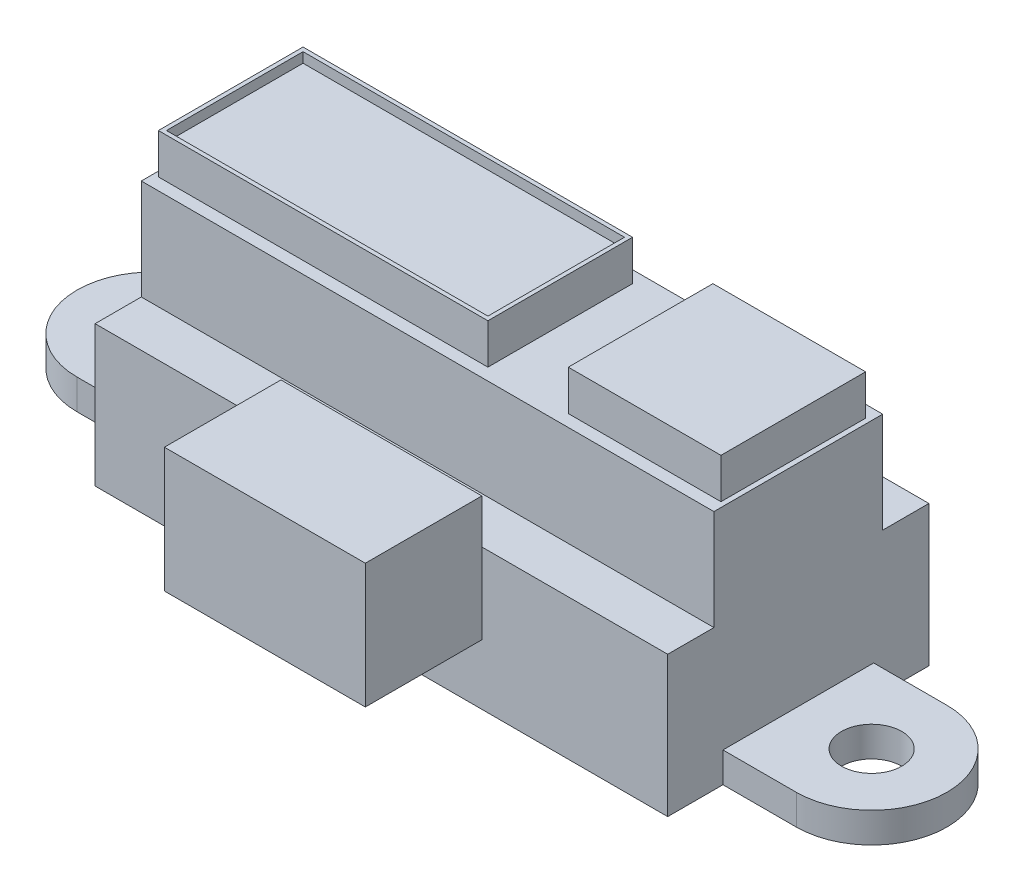
ISO-10303-21;
HEADER;
FILE_DESCRIPTION(('STEP AP214'),'2;1');
FILE_NAME('part.step','',(''),(''),'','','');
FILE_SCHEMA(('AUTOMOTIVE_DESIGN { 1 0 10303 214 1 1 1 1 }'));
ENDSEC;
DATA;
#1=APPLICATION_CONTEXT('core data for automotive mechanical design processes');
#2=APPLICATION_PROTOCOL_DEFINITION('international standard','automotive_design',2000,#1);
#3=PRODUCT_CONTEXT('',#1,'mechanical');
#4=PRODUCT('Part','Part','',(#3));
#5=PRODUCT_RELATED_PRODUCT_CATEGORY('part','',(#4));
#6=PRODUCT_DEFINITION_FORMATION('','',#4);
#7=PRODUCT_DEFINITION_CONTEXT('part definition',#1,'design');
#8=PRODUCT_DEFINITION('design','',#6,#7);
#9=PRODUCT_DEFINITION_SHAPE('','',#8);
#10=(LENGTH_UNIT() NAMED_UNIT(*) SI_UNIT(.MILLI.,.METRE.));
#11=(NAMED_UNIT(*) PLANE_ANGLE_UNIT() SI_UNIT($,.RADIAN.));
#12=(NAMED_UNIT(*) SI_UNIT($,.STERADIAN.) SOLID_ANGLE_UNIT());
#13=UNCERTAINTY_MEASURE_WITH_UNIT(LENGTH_MEASURE(1.E-05),#10,'distance_accuracy_value','');
#14=(GEOMETRIC_REPRESENTATION_CONTEXT(3) GLOBAL_UNCERTAINTY_ASSIGNED_CONTEXT((#13)) GLOBAL_UNIT_ASSIGNED_CONTEXT((#10,
#11,#12)) REPRESENTATION_CONTEXT('',''));
#15=CARTESIAN_POINT('',(0.,0.,0.));
#16=DIRECTION('',(0.,0.,1.));
#17=DIRECTION('',(1.,0.,0.));
#18=AXIS2_PLACEMENT_3D('',#15,#16,#17);
#19=CARTESIAN_POINT('',(-14.25,7.,6.5));
#20=DIRECTION('',(0.,0.,-1.));
#21=DIRECTION('',(-1.,0.,0.));
#22=AXIS2_PLACEMENT_3D('',#19,#20,#21);
#23=PLANE('',#22);
#24=DIRECTION('',(0.,-1.,0.));
#25=VECTOR('',#24,1.);
#26=CARTESIAN_POINT('',(-5.,9.2,6.5));
#27=LINE('',#26,#25);
#28=CARTESIAN_POINT('',(-5.,7.,6.5));
#29=VERTEX_POINT('',#28);
#30=CARTESIAN_POINT('',(-5.,3.,6.5));
#31=VERTEX_POINT('',#30);
#32=EDGE_CURVE('E11',#29,#31,#27,.T.);
#33=ORIENTED_EDGE('',*,*,#32,.F.);
#34=DIRECTION('',(1.,0.,0.));
#35=VECTOR('',#34,1.);
#36=CARTESIAN_POINT('',(-14.25,7.,6.5));
#37=LINE('',#36,#35);
#38=CARTESIAN_POINT('',(-14.25,7.,6.5));
#39=VERTEX_POINT('',#38);
#40=EDGE_CURVE('E481',#39,#29,#37,.T.);
#41=ORIENTED_EDGE('',*,*,#40,.F.);
#42=DIRECTION('',(0.,-1.,0.));
#43=VECTOR('',#42,1.);
#44=CARTESIAN_POINT('',(-14.25,7.,6.5));
#45=LINE('',#44,#43);
#46=CARTESIAN_POINT('',(-14.25,0.,6.5));
#47=VERTEX_POINT('',#46);
#48=EDGE_CURVE('E499',#39,#47,#45,.T.);
#49=ORIENTED_EDGE('',*,*,#48,.T.);
#50=DIRECTION('',(1.,0.,0.));
#51=VECTOR('',#50,1.);
#52=CARTESIAN_POINT('',(-14.25,0.,6.5));
#53=LINE('',#52,#51);
#54=CARTESIAN_POINT('',(14.25,0.,6.5));
#55=VERTEX_POINT('',#54);
#56=EDGE_CURVE('E495',#47,#55,#53,.T.);
#57=ORIENTED_EDGE('',*,*,#56,.T.);
#58=DIRECTION('',(0.,-1.,0.));
#59=VECTOR('',#58,1.);
#60=CARTESIAN_POINT('',(14.25,7.,6.5));
#61=LINE('',#60,#59);
#62=CARTESIAN_POINT('',(14.25,7.,6.5));
#63=VERTEX_POINT('',#62);
#64=EDGE_CURVE('E484',#63,#55,#61,.T.);
#65=ORIENTED_EDGE('',*,*,#64,.F.);
#66=CARTESIAN_POINT('',(5.,7.,6.5));
#67=VERTEX_POINT('',#66);
#68=EDGE_CURVE('E480',#67,#63,#37,.T.);
#69=ORIENTED_EDGE('',*,*,#68,.F.);
#70=DIRECTION('',(0.,-1.,0.));
#71=VECTOR('',#70,1.);
#72=CARTESIAN_POINT('',(5.,9.2,6.5));
#73=LINE('',#72,#71);
#74=CARTESIAN_POINT('',(5.,3.,6.5));
#75=VERTEX_POINT('',#74);
#76=EDGE_CURVE('E42',#67,#75,#73,.T.);
#77=ORIENTED_EDGE('',*,*,#76,.T.);
#78=DIRECTION('',(-1.,0.,0.));
#79=VECTOR('',#78,1.);
#80=CARTESIAN_POINT('',(-5.,3.,6.5));
#81=LINE('',#80,#79);
#82=EDGE_CURVE('E51',#75,#31,#81,.T.);
#83=ORIENTED_EDGE('',*,*,#82,.T.);
#84=EDGE_LOOP('',(#33,#41,#49,#57,#65,#69,#77,#83));
#85=FACE_BOUND('',#84,.T.);
#86=ADVANCED_FACE('F33',(#85),#23,.F.);
#87=CARTESIAN_POINT('',(14.25,7.,6.5));
#88=DIRECTION('',(-1.,0.,0.));
#89=DIRECTION('',(0.,0.,1.));
#90=AXIS2_PLACEMENT_3D('',#87,#88,#89);
#91=PLANE('',#90);
#92=DIRECTION('',(0.,-1.,0.));
#93=VECTOR('',#92,1.);
#94=CARTESIAN_POINT('',(14.25,1.5,3.75));
#95=LINE('',#94,#93);
#96=CARTESIAN_POINT('',(14.25,1.5,3.75));
#97=VERTEX_POINT('',#96);
#98=CARTESIAN_POINT('',(14.25,0.,3.75));
#99=VERTEX_POINT('',#98);
#100=EDGE_CURVE('E309',#97,#99,#95,.T.);
#101=ORIENTED_EDGE('',*,*,#100,.F.);
#102=DIRECTION('',(0.,0.,-1.));
#103=VECTOR('',#102,1.);
#104=CARTESIAN_POINT('',(14.25,1.5,-3.75));
#105=LINE('',#104,#103);
#106=CARTESIAN_POINT('',(14.25,1.5,-3.75));
#107=VERTEX_POINT('',#106);
#108=EDGE_CURVE('E289',#97,#107,#105,.T.);
#109=ORIENTED_EDGE('',*,*,#108,.T.);
#110=DIRECTION('',(0.,-1.,0.));
#111=VECTOR('',#110,1.);
#112=CARTESIAN_POINT('',(14.25,1.5,-3.75));
#113=LINE('',#112,#111);
#114=CARTESIAN_POINT('',(14.25,0.,-3.75));
#115=VERTEX_POINT('',#114);
#116=EDGE_CURVE('E311',#107,#115,#113,.T.);
#117=ORIENTED_EDGE('',*,*,#116,.T.);
#118=DIRECTION('',(0.,0.,-1.));
#119=VECTOR('',#118,1.);
#120=CARTESIAN_POINT('',(14.25,0.,6.5));
#121=LINE('',#120,#119);
#122=CARTESIAN_POINT('',(14.25,0.,-6.5));
#123=VERTEX_POINT('',#122);
#124=EDGE_CURVE('E471',#115,#123,#121,.T.);
#125=ORIENTED_EDGE('',*,*,#124,.T.);
#126=DIRECTION('',(0.,-1.,0.));
#127=VECTOR('',#126,1.);
#128=CARTESIAN_POINT('',(14.25,7.,-6.5));
#129=LINE('',#128,#127);
#130=CARTESIAN_POINT('',(14.25,7.,-6.5));
#131=VERTEX_POINT('',#130);
#132=EDGE_CURVE('E37',#131,#123,#129,.T.);
#133=ORIENTED_EDGE('',*,*,#132,.F.);
#134=DIRECTION('',(0.,0.,-1.));
#135=VECTOR('',#134,1.);
#136=CARTESIAN_POINT('',(14.25,7.,6.5));
#137=LINE('',#136,#135);
#138=CARTESIAN_POINT('',(14.25,7.,-4.2));
#139=VERTEX_POINT('',#138);
#140=EDGE_CURVE('E475',#139,#131,#137,.T.);
#141=ORIENTED_EDGE('',*,*,#140,.F.);
#142=DIRECTION('',(0.,-1.,0.));
#143=VECTOR('',#142,1.);
#144=CARTESIAN_POINT('',(14.25,12.,-4.2));
#145=LINE('',#144,#143);
#146=CARTESIAN_POINT('',(14.25,12.,-4.2));
#147=VERTEX_POINT('',#146);
#148=EDGE_CURVE('E468',#147,#139,#145,.T.);
#149=ORIENTED_EDGE('',*,*,#148,.F.);
#150=DIRECTION('',(0.,0.,-1.));
#151=VECTOR('',#150,1.);
#152=CARTESIAN_POINT('',(14.25,12.,4.2));
#153=LINE('',#152,#151);
#154=CARTESIAN_POINT('',(14.25,12.,4.2));
#155=VERTEX_POINT('',#154);
#156=EDGE_CURVE('E445',#155,#147,#153,.T.);
#157=ORIENTED_EDGE('',*,*,#156,.F.);
#158=DIRECTION('',(0.,-1.,0.));
#159=VECTOR('',#158,1.);
#160=CARTESIAN_POINT('',(14.25,12.,4.2));
#161=LINE('',#160,#159);
#162=CARTESIAN_POINT('',(14.25,7.,4.2));
#163=VERTEX_POINT('',#162);
#164=EDGE_CURVE('E455',#155,#163,#161,.T.);
#165=ORIENTED_EDGE('',*,*,#164,.T.);
#166=EDGE_CURVE('E472',#63,#163,#137,.T.);
#167=ORIENTED_EDGE('',*,*,#166,.F.);
#168=ORIENTED_EDGE('',*,*,#64,.T.);
#169=EDGE_CURVE('E486',#55,#99,#121,.T.);
#170=ORIENTED_EDGE('',*,*,#169,.T.);
#171=EDGE_LOOP('',(#101,#109,#117,#125,#133,#141,#149,#157,#165,#167,#168,#170));
#172=FACE_BOUND('',#171,.T.);
#173=ADVANCED_FACE('F35',(#172),#91,.F.);
#174=CARTESIAN_POINT('',(-14.25,7.,6.5));
#175=DIRECTION('',(1.,0.,0.));
#176=DIRECTION('',(0.,0.,-1.));
#177=AXIS2_PLACEMENT_3D('',#174,#175,#176);
#178=PLANE('',#177);
#179=DIRECTION('',(0.,-1.,0.));
#180=VECTOR('',#179,1.);
#181=CARTESIAN_POINT('',(-14.25,1.5,-3.75));
#182=LINE('',#181,#180);
#183=CARTESIAN_POINT('',(-14.25,1.5,-3.75));
#184=VERTEX_POINT('',#183);
#185=CARTESIAN_POINT('',(-14.25,0.,-3.75));
#186=VERTEX_POINT('',#185);
#187=EDGE_CURVE('E330',#184,#186,#182,.T.);
#188=ORIENTED_EDGE('',*,*,#187,.F.);
#189=DIRECTION('',(0.,0.,-1.));
#190=VECTOR('',#189,1.);
#191=CARTESIAN_POINT('',(-14.25,1.5,-3.75));
#192=LINE('',#191,#190);
#193=CARTESIAN_POINT('',(-14.25,1.5,3.75));
#194=VERTEX_POINT('',#193);
#195=EDGE_CURVE('E328',#194,#184,#192,.T.);
#196=ORIENTED_EDGE('',*,*,#195,.F.);
#197=DIRECTION('',(0.,-1.,0.));
#198=VECTOR('',#197,1.);
#199=CARTESIAN_POINT('',(-14.25,1.5,3.75));
#200=LINE('',#199,#198);
#201=CARTESIAN_POINT('',(-14.25,0.,3.75000000000001));
#202=VERTEX_POINT('',#201);
#203=EDGE_CURVE('E337',#194,#202,#200,.T.);
#204=ORIENTED_EDGE('',*,*,#203,.T.);
#205=DIRECTION('',(0.,0.,1.));
#206=VECTOR('',#205,1.);
#207=CARTESIAN_POINT('',(-14.25,0.,6.5));
#208=LINE('',#207,#206);
#209=EDGE_CURVE('E491',#202,#47,#208,.T.);
#210=ORIENTED_EDGE('',*,*,#209,.T.);
#211=ORIENTED_EDGE('',*,*,#48,.F.);
#212=DIRECTION('',(0.,0.,1.));
#213=VECTOR('',#212,1.);
#214=CARTESIAN_POINT('',(-14.25,7.,6.5));
#215=LINE('',#214,#213);
#216=CARTESIAN_POINT('',(-14.25,7.,4.2));
#217=VERTEX_POINT('',#216);
#218=EDGE_CURVE('E477',#217,#39,#215,.T.);
#219=ORIENTED_EDGE('',*,*,#218,.F.);
#220=DIRECTION('',(0.,-1.,0.));
#221=VECTOR('',#220,1.);
#222=CARTESIAN_POINT('',(-14.25,12.,4.2));
#223=LINE('',#222,#221);
#224=CARTESIAN_POINT('',(-14.25,12.,4.2));
#225=VERTEX_POINT('',#224);
#226=EDGE_CURVE('E462',#225,#217,#223,.T.);
#227=ORIENTED_EDGE('',*,*,#226,.F.);
#228=DIRECTION('',(0.,0.,1.));
#229=VECTOR('',#228,1.);
#230=CARTESIAN_POINT('',(-14.25,12.,4.2));
#231=LINE('',#230,#229);
#232=CARTESIAN_POINT('',(-14.25,12.,-4.2));
#233=VERTEX_POINT('',#232);
#234=EDGE_CURVE('E451',#233,#225,#231,.T.);
#235=ORIENTED_EDGE('',*,*,#234,.F.);
#236=DIRECTION('',(0.,-1.,0.));
#237=VECTOR('',#236,1.);
#238=CARTESIAN_POINT('',(-14.25,12.,-4.2));
#239=LINE('',#238,#237);
#240=CARTESIAN_POINT('',(-14.25,7.,-4.2));
#241=VERTEX_POINT('',#240);
#242=EDGE_CURVE('E465',#233,#241,#239,.T.);
#243=ORIENTED_EDGE('',*,*,#242,.T.);
#244=CARTESIAN_POINT('',(-14.25,7.,-6.5));
#245=VERTEX_POINT('',#244);
#246=EDGE_CURVE('E478',#245,#241,#215,.T.);
#247=ORIENTED_EDGE('',*,*,#246,.F.);
#248=DIRECTION('',(0.,-1.,0.));
#249=VECTOR('',#248,1.);
#250=CARTESIAN_POINT('',(-14.25,7.,-6.5));
#251=LINE('',#250,#249);
#252=CARTESIAN_POINT('',(-14.25,0.,-6.5));
#253=VERTEX_POINT('',#252);
#254=EDGE_CURVE('E501',#245,#253,#251,.T.);
#255=ORIENTED_EDGE('',*,*,#254,.T.);
#256=EDGE_CURVE('E492',#253,#186,#208,.T.);
#257=ORIENTED_EDGE('',*,*,#256,.T.);
#258=EDGE_LOOP('',(#188,#196,#204,#210,#211,#219,#227,#235,#243,#247,#255,#257));
#259=FACE_BOUND('',#258,.T.);
#260=ADVANCED_FACE('F548',(#259),#178,.F.);
#261=CARTESIAN_POINT('',(0.,12.,0.));
#262=DIRECTION('',(0.,-1.,0.));
#263=DIRECTION('',(0.,0.,-1.));
#264=AXIS2_PLACEMENT_3D('',#261,#262,#263);
#265=PLANE('',#264);
#266=DIRECTION('',(0.,0.,1.));
#267=VECTOR('',#266,1.);
#268=CARTESIAN_POINT('',(-14.,12.,-3.6));
#269=LINE('',#268,#267);
#270=CARTESIAN_POINT('',(-14.,12.,-3.6));
#271=VERTEX_POINT('',#270);
#272=CARTESIAN_POINT('',(-14.,12.,3.6));
#273=VERTEX_POINT('',#272);
#274=EDGE_CURVE('E411',#271,#273,#269,.T.);
#275=ORIENTED_EDGE('',*,*,#274,.F.);
#276=DIRECTION('',(-1.,0.,0.));
#277=VECTOR('',#276,1.);
#278=CARTESIAN_POINT('',(-14.,12.,-3.6));
#279=LINE('',#278,#277);
#280=CARTESIAN_POINT('',(2.39999999999999,12.,-3.6));
#281=VERTEX_POINT('',#280);
#282=EDGE_CURVE('E416',#281,#271,#279,.T.);
#283=ORIENTED_EDGE('',*,*,#282,.F.);
#284=DIRECTION('',(0.,0.,-1.));
#285=VECTOR('',#284,1.);
#286=CARTESIAN_POINT('',(2.39999999999999,12.,-3.6));
#287=LINE('',#286,#285);
#288=CARTESIAN_POINT('',(2.39999999999999,12.,3.6));
#289=VERTEX_POINT('',#288);
#290=EDGE_CURVE('E428',#289,#281,#287,.T.);
#291=ORIENTED_EDGE('',*,*,#290,.F.);
#292=DIRECTION('',(1.,0.,0.));
#293=VECTOR('',#292,1.);
#294=CARTESIAN_POINT('',(-14.,12.,3.6));
#295=LINE('',#294,#293);
#296=EDGE_CURVE('E425',#273,#289,#295,.T.);
#297=ORIENTED_EDGE('',*,*,#296,.F.);
#298=EDGE_LOOP('',(#275,#283,#291,#297));
#299=FACE_BOUND('',#298,.T.);
#300=ORIENTED_EDGE('',*,*,#156,.T.);
#301=DIRECTION('',(-1.,0.,0.));
#302=VECTOR('',#301,1.);
#303=CARTESIAN_POINT('',(-14.25,12.,-4.2));
#304=LINE('',#303,#302);
#305=EDGE_CURVE('E448',#147,#233,#304,.T.);
#306=ORIENTED_EDGE('',*,*,#305,.T.);
#307=ORIENTED_EDGE('',*,*,#234,.T.);
#308=DIRECTION('',(1.,0.,0.));
#309=VECTOR('',#308,1.);
#310=CARTESIAN_POINT('',(-14.25,12.,4.2));
#311=LINE('',#310,#309);
#312=EDGE_CURVE('E453',#225,#155,#311,.T.);
#313=ORIENTED_EDGE('',*,*,#312,.T.);
#314=EDGE_LOOP('',(#300,#306,#307,#313));
#315=FACE_BOUND('',#314,.T.);
#316=DIRECTION('',(0.,0.,-1.));
#317=VECTOR('',#316,1.);
#318=CARTESIAN_POINT('',(14.,12.,-3.6));
#319=LINE('',#318,#317);
#320=CARTESIAN_POINT('',(14.,12.,3.6));
#321=VERTEX_POINT('',#320);
#322=CARTESIAN_POINT('',(14.,12.,-3.6));
#323=VERTEX_POINT('',#322);
#324=EDGE_CURVE('E372',#321,#323,#319,.T.);
#325=ORIENTED_EDGE('',*,*,#324,.F.);
#326=DIRECTION('',(1.,0.,0.));
#327=VECTOR('',#326,1.);
#328=CARTESIAN_POINT('',(14.,12.,3.6));
#329=LINE('',#328,#327);
#330=CARTESIAN_POINT('',(6.4,12.,3.6));
#331=VERTEX_POINT('',#330);
#332=EDGE_CURVE('E383',#331,#321,#329,.T.);
#333=ORIENTED_EDGE('',*,*,#332,.F.);
#334=DIRECTION('',(0.,0.,1.));
#335=VECTOR('',#334,1.);
#336=CARTESIAN_POINT('',(6.4,12.,-3.6));
#337=LINE('',#336,#335);
#338=CARTESIAN_POINT('',(6.4,12.,-3.6));
#339=VERTEX_POINT('',#338);
#340=EDGE_CURVE('E395',#339,#331,#337,.T.);
#341=ORIENTED_EDGE('',*,*,#340,.F.);
#342=DIRECTION('',(-1.,0.,0.));
#343=VECTOR('',#342,1.);
#344=CARTESIAN_POINT('',(14.,12.,-3.6));
#345=LINE('',#344,#343);
#346=EDGE_CURVE('E392',#323,#339,#345,.T.);
#347=ORIENTED_EDGE('',*,*,#346,.F.);
#348=EDGE_LOOP('',(#325,#333,#341,#347));
#349=FACE_BOUND('',#348,.T.);
#350=ADVANCED_FACE('F570',(#299,#315,#349),#265,.F.);
#351=CARTESIAN_POINT('',(0.,7.,0.));
#352=DIRECTION('',(0.,-1.,0.));
#353=DIRECTION('',(0.,0.,-1.));
#354=AXIS2_PLACEMENT_3D('',#351,#352,#353);
#355=PLANE('',#354);
#356=DIRECTION('',(1.,0.,0.));
#357=VECTOR('',#356,1.);
#358=CARTESIAN_POINT('',(-14.25,7.,4.2));
#359=LINE('',#358,#357);
#360=EDGE_CURVE('E449',#217,#163,#359,.T.);
#361=ORIENTED_EDGE('',*,*,#360,.F.);
#362=ORIENTED_EDGE('',*,*,#218,.T.);
#363=ORIENTED_EDGE('',*,*,#40,.T.);
#364=EDGE_CURVE('E485',#29,#67,#37,.T.);
#365=ORIENTED_EDGE('',*,*,#364,.T.);
#366=ORIENTED_EDGE('',*,*,#68,.T.);
#367=ORIENTED_EDGE('',*,*,#166,.T.);
#368=EDGE_LOOP('',(#361,#362,#363,#365,#366,#367));
#369=FACE_BOUND('',#368,.T.);
#370=ADVANCED_FACE('F532',(#369),#355,.F.);
#371=DIRECTION('',(-1.,0.,0.));
#372=VECTOR('',#371,1.);
#373=CARTESIAN_POINT('',(-14.25,7.,-4.2));
#374=LINE('',#373,#372);
#375=EDGE_CURVE('E444',#139,#241,#374,.T.);
#376=ORIENTED_EDGE('',*,*,#375,.F.);
#377=ORIENTED_EDGE('',*,*,#140,.T.);
#378=DIRECTION('',(-1.,0.,0.));
#379=VECTOR('',#378,1.);
#380=CARTESIAN_POINT('',(-14.25,7.,-6.5));
#381=LINE('',#380,#379);
#382=EDGE_CURVE('E474',#131,#245,#381,.T.);
#383=ORIENTED_EDGE('',*,*,#382,.T.);
#384=ORIENTED_EDGE('',*,*,#246,.T.);
#385=EDGE_LOOP('',(#376,#377,#383,#384));
#386=FACE_BOUND('',#385,.T.);
#387=ADVANCED_FACE('F573',(#386),#355,.F.);
#388=CARTESIAN_POINT('',(-14.25,7.,-6.5));
#389=DIRECTION('',(0.,0.,1.));
#390=DIRECTION('',(1.,0.,0.));
#391=AXIS2_PLACEMENT_3D('',#388,#389,#390);
#392=PLANE('',#391);
#393=DIRECTION('',(-1.,0.,0.));
#394=VECTOR('',#393,1.);
#395=CARTESIAN_POINT('',(-14.25,0.,-6.5));
#396=LINE('',#395,#394);
#397=EDGE_CURVE('E489',#123,#253,#396,.T.);
#398=ORIENTED_EDGE('',*,*,#397,.T.);
#399=ORIENTED_EDGE('',*,*,#254,.F.);
#400=ORIENTED_EDGE('',*,*,#382,.F.);
#401=ORIENTED_EDGE('',*,*,#132,.T.);
#402=EDGE_LOOP('',(#398,#399,#400,#401));
#403=FACE_BOUND('',#402,.T.);
#404=ADVANCED_FACE('F571',(#403),#392,.F.);
#405=CARTESIAN_POINT('',(0.,0.,0.));
#406=DIRECTION('',(0.,-1.,0.));
#407=DIRECTION('',(0.,0.,-1.));
#408=AXIS2_PLACEMENT_3D('',#405,#406,#407);
#409=PLANE('',#408);
#410=ORIENTED_EDGE('',*,*,#169,.F.);
#411=ORIENTED_EDGE('',*,*,#56,.F.);
#412=ORIENTED_EDGE('',*,*,#209,.F.);
#413=DIRECTION('',(1.,0.,0.));
#414=VECTOR('',#413,1.);
#415=CARTESIAN_POINT('',(-14.25,0.,3.75));
#416=LINE('',#415,#414);
#417=CARTESIAN_POINT('',(-17.9,0.,3.75));
#418=VERTEX_POINT('',#417);
#419=EDGE_CURVE('E324',#418,#202,#416,.T.);
#420=ORIENTED_EDGE('',*,*,#419,.F.);
#421=CARTESIAN_POINT('',(-17.9,0.,0.));
#422=DIRECTION('',(0.,1.,0.));
#423=DIRECTION('',(0.,0.,1.));
#424=AXIS2_PLACEMENT_3D('',#421,#422,#423);
#425=CIRCLE('',#424,3.75);
#426=CARTESIAN_POINT('',(-17.9,0.,-3.75));
#427=VERTEX_POINT('',#426);
#428=EDGE_CURVE('E333',#427,#418,#425,.T.);
#429=ORIENTED_EDGE('',*,*,#428,.F.);
#430=DIRECTION('',(-1.,0.,0.));
#431=VECTOR('',#430,1.);
#432=CARTESIAN_POINT('',(-14.25,0.,-3.75));
#433=LINE('',#432,#431);
#434=EDGE_CURVE('E317',#186,#427,#433,.T.);
#435=ORIENTED_EDGE('',*,*,#434,.F.);
#436=ORIENTED_EDGE('',*,*,#256,.F.);
#437=ORIENTED_EDGE('',*,*,#397,.F.);
#438=ORIENTED_EDGE('',*,*,#124,.F.);
#439=DIRECTION('',(1.,0.,0.));
#440=VECTOR('',#439,1.);
#441=CARTESIAN_POINT('',(14.25,0.,-3.75));
#442=LINE('',#441,#440);
#443=CARTESIAN_POINT('',(17.9,0.,-3.75));
#444=VERTEX_POINT('',#443);
#445=EDGE_CURVE('E59',#115,#444,#442,.T.);
#446=ORIENTED_EDGE('',*,*,#445,.T.);
#447=CARTESIAN_POINT('',(17.9,0.,0.));
#448=DIRECTION('',(0.,-1.,0.));
#449=DIRECTION('',(0.,0.,1.));
#450=AXIS2_PLACEMENT_3D('',#447,#448,#449);
#451=CIRCLE('',#450,3.75);
#452=CARTESIAN_POINT('',(17.9,0.,3.75));
#453=VERTEX_POINT('',#452);
#454=EDGE_CURVE('E290',#444,#453,#451,.T.);
#455=ORIENTED_EDGE('',*,*,#454,.T.);
#456=DIRECTION('',(-1.,0.,0.));
#457=VECTOR('',#456,1.);
#458=CARTESIAN_POINT('',(14.25,0.,3.75));
#459=LINE('',#458,#457);
#460=EDGE_CURVE('E301',#453,#99,#459,.T.);
#461=ORIENTED_EDGE('',*,*,#460,.T.);
#462=EDGE_LOOP('',(#410,#411,#412,#420,#429,#435,#436,#437,#438,#446,#455,#461));
#463=FACE_BOUND('',#462,.T.);
#464=CARTESIAN_POINT('',(-17.9,0.,0.));
#465=DIRECTION('',(0.,1.,0.));
#466=DIRECTION('',(0.,0.,1.));
#467=AXIS2_PLACEMENT_3D('',#464,#465,#466);
#468=CIRCLE('',#467,1.5);
#469=CARTESIAN_POINT('',(-17.9,0.,1.5));
#470=VERTEX_POINT('',#469);
#471=EDGE_CURVE('E313',#470,#470,#468,.T.);
#472=ORIENTED_EDGE('',*,*,#471,.T.);
#473=EDGE_LOOP('',(#472));
#474=FACE_BOUND('',#473,.T.);
#475=CARTESIAN_POINT('',(17.9,0.,0.));
#476=DIRECTION('',(0.,-1.,0.));
#477=DIRECTION('',(0.,0.,1.));
#478=AXIS2_PLACEMENT_3D('',#475,#476,#477);
#479=CIRCLE('',#478,1.5);
#480=CARTESIAN_POINT('',(17.9,0.,1.5));
#481=VERTEX_POINT('',#480);
#482=EDGE_CURVE('E275',#481,#481,#479,.T.);
#483=ORIENTED_EDGE('',*,*,#482,.F.);
#484=EDGE_LOOP('',(#483));
#485=FACE_BOUND('',#484,.T.);
#486=ADVANCED_FACE('F567',(#463,#474,#485),#409,.T.);
#487=CARTESIAN_POINT('',(-14.25,12.,-4.2));
#488=DIRECTION('',(0.,0.,1.));
#489=DIRECTION('',(1.,0.,0.));
#490=AXIS2_PLACEMENT_3D('',#487,#488,#489);
#491=PLANE('',#490);
#492=ORIENTED_EDGE('',*,*,#375,.T.);
#493=ORIENTED_EDGE('',*,*,#242,.F.);
#494=ORIENTED_EDGE('',*,*,#305,.F.);
#495=ORIENTED_EDGE('',*,*,#148,.T.);
#496=EDGE_LOOP('',(#492,#493,#494,#495));
#497=FACE_BOUND('',#496,.T.);
#498=ADVANCED_FACE('F578',(#497),#491,.F.);
#499=CARTESIAN_POINT('',(-14.25,12.,4.2));
#500=DIRECTION('',(0.,0.,-1.));
#501=DIRECTION('',(-1.,0.,0.));
#502=AXIS2_PLACEMENT_3D('',#499,#500,#501);
#503=PLANE('',#502);
#504=ORIENTED_EDGE('',*,*,#360,.T.);
#505=ORIENTED_EDGE('',*,*,#164,.F.);
#506=ORIENTED_EDGE('',*,*,#312,.F.);
#507=ORIENTED_EDGE('',*,*,#226,.T.);
#508=EDGE_LOOP('',(#504,#505,#506,#507));
#509=FACE_BOUND('',#508,.T.);
#510=ADVANCED_FACE('F543',(#509),#503,.F.);
#511=CARTESIAN_POINT('',(-14.,14.,-3.6));
#512=DIRECTION('',(1.,0.,0.));
#513=DIRECTION('',(0.,0.,-1.));
#514=AXIS2_PLACEMENT_3D('',#511,#512,#513);
#515=PLANE('',#514);
#516=ORIENTED_EDGE('',*,*,#274,.T.);
#517=DIRECTION('',(0.,-1.,0.));
#518=VECTOR('',#517,1.);
#519=CARTESIAN_POINT('',(-14.,14.,3.6));
#520=LINE('',#519,#518);
#521=CARTESIAN_POINT('',(-14.,14.,3.6));
#522=VERTEX_POINT('',#521);
#523=EDGE_CURVE('E441',#522,#273,#520,.T.);
#524=ORIENTED_EDGE('',*,*,#523,.F.);
#525=DIRECTION('',(0.,0.,1.));
#526=VECTOR('',#525,1.);
#527=CARTESIAN_POINT('',(-14.,14.,-3.6));
#528=LINE('',#527,#526);
#529=CARTESIAN_POINT('',(-14.,14.,-3.6));
#530=VERTEX_POINT('',#529);
#531=EDGE_CURVE('E412',#530,#522,#528,.T.);
#532=ORIENTED_EDGE('',*,*,#531,.F.);
#533=DIRECTION('',(0.,-1.,0.));
#534=VECTOR('',#533,1.);
#535=CARTESIAN_POINT('',(-14.,14.,-3.6));
#536=LINE('',#535,#534);
#537=EDGE_CURVE('E422',#530,#271,#536,.T.);
#538=ORIENTED_EDGE('',*,*,#537,.T.);
#539=EDGE_LOOP('',(#516,#524,#532,#538));
#540=FACE_BOUND('',#539,.T.);
#541=ADVANCED_FACE('F661',(#540),#515,.F.);
#542=CARTESIAN_POINT('',(-14.,14.,3.6));
#543=DIRECTION('',(0.,0.,-1.));
#544=DIRECTION('',(-1.,0.,0.));
#545=AXIS2_PLACEMENT_3D('',#542,#543,#544);
#546=PLANE('',#545);
#547=ORIENTED_EDGE('',*,*,#296,.T.);
#548=DIRECTION('',(0.,-1.,0.));
#549=VECTOR('',#548,1.);
#550=CARTESIAN_POINT('',(2.39999999999999,14.,3.6));
#551=LINE('',#550,#549);
#552=CARTESIAN_POINT('',(2.39999999999999,14.,3.6));
#553=VERTEX_POINT('',#552);
#554=EDGE_CURVE('E438',#553,#289,#551,.T.);
#555=ORIENTED_EDGE('',*,*,#554,.F.);
#556=DIRECTION('',(1.,0.,0.));
#557=VECTOR('',#556,1.);
#558=CARTESIAN_POINT('',(-14.,14.,3.6));
#559=LINE('',#558,#557);
#560=EDGE_CURVE('E415',#522,#553,#559,.T.);
#561=ORIENTED_EDGE('',*,*,#560,.F.);
#562=ORIENTED_EDGE('',*,*,#523,.T.);
#563=EDGE_LOOP('',(#547,#555,#561,#562));
#564=FACE_BOUND('',#563,.T.);
#565=ADVANCED_FACE('F657',(#564),#546,.F.);
#566=CARTESIAN_POINT('',(2.39999999999999,14.,-3.6));
#567=DIRECTION('',(-1.,0.,0.));
#568=DIRECTION('',(0.,0.,1.));
#569=AXIS2_PLACEMENT_3D('',#566,#567,#568);
#570=PLANE('',#569);
#571=ORIENTED_EDGE('',*,*,#290,.T.);
#572=DIRECTION('',(0.,-1.,0.));
#573=VECTOR('',#572,1.);
#574=CARTESIAN_POINT('',(2.39999999999999,14.,-3.6));
#575=LINE('',#574,#573);
#576=CARTESIAN_POINT('',(2.39999999999999,14.,-3.6));
#577=VERTEX_POINT('',#576);
#578=EDGE_CURVE('E435',#577,#281,#575,.T.);
#579=ORIENTED_EDGE('',*,*,#578,.F.);
#580=DIRECTION('',(0.,0.,-1.));
#581=VECTOR('',#580,1.);
#582=CARTESIAN_POINT('',(2.39999999999999,14.,-3.6));
#583=LINE('',#582,#581);
#584=EDGE_CURVE('E418',#553,#577,#583,.T.);
#585=ORIENTED_EDGE('',*,*,#584,.F.);
#586=ORIENTED_EDGE('',*,*,#554,.T.);
#587=EDGE_LOOP('',(#571,#579,#585,#586));
#588=FACE_BOUND('',#587,.T.);
#589=ADVANCED_FACE('F653',(#588),#570,.F.);
#590=CARTESIAN_POINT('',(-14.,14.,-3.6));
#591=DIRECTION('',(0.,0.,1.));
#592=DIRECTION('',(1.,0.,0.));
#593=AXIS2_PLACEMENT_3D('',#590,#591,#592);
#594=PLANE('',#593);
#595=ORIENTED_EDGE('',*,*,#282,.T.);
#596=ORIENTED_EDGE('',*,*,#537,.F.);
#597=DIRECTION('',(-1.,0.,0.));
#598=VECTOR('',#597,1.);
#599=CARTESIAN_POINT('',(-14.,14.,-3.6));
#600=LINE('',#599,#598);
#601=EDGE_CURVE('E420',#577,#530,#600,.T.);
#602=ORIENTED_EDGE('',*,*,#601,.F.);
#603=ORIENTED_EDGE('',*,*,#578,.T.);
#604=EDGE_LOOP('',(#595,#596,#602,#603));
#605=FACE_BOUND('',#604,.T.);
#606=ADVANCED_FACE('F649',(#605),#594,.F.);
#607=CARTESIAN_POINT('',(0.,14.,0.));
#608=DIRECTION('',(0.,1.,0.));
#609=DIRECTION('',(0.,0.,1.));
#610=AXIS2_PLACEMENT_3D('',#607,#608,#609);
#611=PLANE('',#610);
#612=DIRECTION('',(-1.,0.,0.));
#613=VECTOR('',#612,1.);
#614=CARTESIAN_POINT('',(2.19999999999999,14.,-3.4));
#615=LINE('',#614,#613);
#616=CARTESIAN_POINT('',(2.19999999999999,14.,-3.4));
#617=VERTEX_POINT('',#616);
#618=CARTESIAN_POINT('',(-13.8,14.,-3.4));
#619=VERTEX_POINT('',#618);
#620=EDGE_CURVE('E346',#617,#619,#615,.T.);
#621=ORIENTED_EDGE('',*,*,#620,.F.);
#622=DIRECTION('',(0.,0.,-1.));
#623=VECTOR('',#622,1.);
#624=CARTESIAN_POINT('',(2.19999999999999,14.,3.4));
#625=LINE('',#624,#623);
#626=CARTESIAN_POINT('',(2.19999999999999,14.,3.4));
#627=VERTEX_POINT('',#626);
#628=EDGE_CURVE('E351',#627,#617,#625,.T.);
#629=ORIENTED_EDGE('',*,*,#628,.F.);
#630=DIRECTION('',(1.,0.,0.));
#631=VECTOR('',#630,1.);
#632=CARTESIAN_POINT('',(-13.8,14.,3.4));
#633=LINE('',#632,#631);
#634=CARTESIAN_POINT('',(-13.8,14.,3.4));
#635=VERTEX_POINT('',#634);
#636=EDGE_CURVE('E365',#635,#627,#633,.T.);
#637=ORIENTED_EDGE('',*,*,#636,.F.);
#638=DIRECTION('',(0.,0.,1.));
#639=VECTOR('',#638,1.);
#640=CARTESIAN_POINT('',(-13.8,14.,-3.4));
#641=LINE('',#640,#639);
#642=EDGE_CURVE('E362',#619,#635,#641,.T.);
#643=ORIENTED_EDGE('',*,*,#642,.F.);
#644=EDGE_LOOP('',(#621,#629,#637,#643));
#645=FACE_BOUND('',#644,.T.);
#646=ORIENTED_EDGE('',*,*,#531,.T.);
#647=ORIENTED_EDGE('',*,*,#560,.T.);
#648=ORIENTED_EDGE('',*,*,#584,.T.);
#649=ORIENTED_EDGE('',*,*,#601,.T.);
#650=EDGE_LOOP('',(#646,#647,#648,#649));
#651=FACE_BOUND('',#650,.T.);
#652=ADVANCED_FACE('F643',(#645,#651),#611,.T.);
#653=CARTESIAN_POINT('',(14.,14.,-3.6));
#654=DIRECTION('',(-1.,0.,0.));
#655=DIRECTION('',(0.,0.,1.));
#656=AXIS2_PLACEMENT_3D('',#653,#654,#655);
#657=PLANE('',#656);
#658=ORIENTED_EDGE('',*,*,#324,.T.);
#659=DIRECTION('',(0.,-1.,0.));
#660=VECTOR('',#659,1.);
#661=CARTESIAN_POINT('',(14.,14.,-3.6));
#662=LINE('',#661,#660);
#663=CARTESIAN_POINT('',(14.,14.,-3.6));
#664=VERTEX_POINT('',#663);
#665=EDGE_CURVE('E408',#664,#323,#662,.T.);
#666=ORIENTED_EDGE('',*,*,#665,.F.);
#667=DIRECTION('',(0.,0.,-1.));
#668=VECTOR('',#667,1.);
#669=CARTESIAN_POINT('',(14.,14.,-3.6));
#670=LINE('',#669,#668);
#671=CARTESIAN_POINT('',(14.,14.,3.6));
#672=VERTEX_POINT('',#671);
#673=EDGE_CURVE('E379',#672,#664,#670,.T.);
#674=ORIENTED_EDGE('',*,*,#673,.F.);
#675=DIRECTION('',(0.,-1.,0.));
#676=VECTOR('',#675,1.);
#677=CARTESIAN_POINT('',(14.,14.,3.6));
#678=LINE('',#677,#676);
#679=EDGE_CURVE('E389',#672,#321,#678,.T.);
#680=ORIENTED_EDGE('',*,*,#679,.T.);
#681=EDGE_LOOP('',(#658,#666,#674,#680));
#682=FACE_BOUND('',#681,.T.);
#683=ADVANCED_FACE('F627',(#682),#657,.F.);
#684=CARTESIAN_POINT('',(14.,14.,-3.6));
#685=DIRECTION('',(0.,0.,1.));
#686=DIRECTION('',(1.,0.,0.));
#687=AXIS2_PLACEMENT_3D('',#684,#685,#686);
#688=PLANE('',#687);
#689=ORIENTED_EDGE('',*,*,#346,.T.);
#690=DIRECTION('',(0.,-1.,0.));
#691=VECTOR('',#690,1.);
#692=CARTESIAN_POINT('',(6.4,14.,-3.6));
#693=LINE('',#692,#691);
#694=CARTESIAN_POINT('',(6.4,14.,-3.6));
#695=VERTEX_POINT('',#694);
#696=EDGE_CURVE('E405',#695,#339,#693,.T.);
#697=ORIENTED_EDGE('',*,*,#696,.F.);
#698=DIRECTION('',(-1.,0.,0.));
#699=VECTOR('',#698,1.);
#700=CARTESIAN_POINT('',(14.,14.,-3.6));
#701=LINE('',#700,#699);
#702=EDGE_CURVE('E382',#664,#695,#701,.T.);
#703=ORIENTED_EDGE('',*,*,#702,.F.);
#704=ORIENTED_EDGE('',*,*,#665,.T.);
#705=EDGE_LOOP('',(#689,#697,#703,#704));
#706=FACE_BOUND('',#705,.T.);
#707=ADVANCED_FACE('F635',(#706),#688,.F.);
#708=CARTESIAN_POINT('',(6.4,14.,-3.6));
#709=DIRECTION('',(1.,0.,0.));
#710=DIRECTION('',(0.,0.,-1.));
#711=AXIS2_PLACEMENT_3D('',#708,#709,#710);
#712=PLANE('',#711);
#713=ORIENTED_EDGE('',*,*,#340,.T.);
#714=DIRECTION('',(0.,-1.,0.));
#715=VECTOR('',#714,1.);
#716=CARTESIAN_POINT('',(6.4,14.,3.6));
#717=LINE('',#716,#715);
#718=CARTESIAN_POINT('',(6.4,14.,3.6));
#719=VERTEX_POINT('',#718);
#720=EDGE_CURVE('E402',#719,#331,#717,.T.);
#721=ORIENTED_EDGE('',*,*,#720,.F.);
#722=DIRECTION('',(0.,0.,1.));
#723=VECTOR('',#722,1.);
#724=CARTESIAN_POINT('',(6.4,14.,-3.6));
#725=LINE('',#724,#723);
#726=EDGE_CURVE('E385',#695,#719,#725,.T.);
#727=ORIENTED_EDGE('',*,*,#726,.F.);
#728=ORIENTED_EDGE('',*,*,#696,.T.);
#729=EDGE_LOOP('',(#713,#721,#727,#728));
#730=FACE_BOUND('',#729,.T.);
#731=ADVANCED_FACE('F633',(#730),#712,.F.);
#732=CARTESIAN_POINT('',(14.,14.,3.6));
#733=DIRECTION('',(0.,0.,-1.));
#734=DIRECTION('',(-1.,0.,0.));
#735=AXIS2_PLACEMENT_3D('',#732,#733,#734);
#736=PLANE('',#735);
#737=ORIENTED_EDGE('',*,*,#332,.T.);
#738=ORIENTED_EDGE('',*,*,#679,.F.);
#739=DIRECTION('',(1.,0.,0.));
#740=VECTOR('',#739,1.);
#741=CARTESIAN_POINT('',(14.,14.,3.6));
#742=LINE('',#741,#740);
#743=EDGE_CURVE('E387',#719,#672,#742,.T.);
#744=ORIENTED_EDGE('',*,*,#743,.F.);
#745=ORIENTED_EDGE('',*,*,#720,.T.);
#746=EDGE_LOOP('',(#737,#738,#744,#745));
#747=FACE_BOUND('',#746,.T.);
#748=ADVANCED_FACE('F623',(#747),#736,.F.);
#749=CARTESIAN_POINT('',(0.,14.,0.));
#750=DIRECTION('',(0.,-1.,0.));
#751=DIRECTION('',(0.,0.,-1.));
#752=AXIS2_PLACEMENT_3D('',#749,#750,#751);
#753=PLANE('',#752);
#754=ORIENTED_EDGE('',*,*,#673,.T.);
#755=ORIENTED_EDGE('',*,*,#702,.T.);
#756=ORIENTED_EDGE('',*,*,#726,.T.);
#757=ORIENTED_EDGE('',*,*,#743,.T.);
#758=EDGE_LOOP('',(#754,#755,#756,#757));
#759=FACE_BOUND('',#758,.T.);
#760=ADVANCED_FACE('F629',(#759),#753,.F.);
#761=CARTESIAN_POINT('',(2.19999999999999,13.5,-3.4));
#762=DIRECTION('',(0.,0.,-1.));
#763=DIRECTION('',(-1.,0.,0.));
#764=AXIS2_PLACEMENT_3D('',#761,#762,#763);
#765=PLANE('',#764);
#766=ORIENTED_EDGE('',*,*,#620,.T.);
#767=DIRECTION('',(0.,1.,0.));
#768=VECTOR('',#767,1.);
#769=CARTESIAN_POINT('',(-13.8,13.5,-3.4));
#770=LINE('',#769,#768);
#771=CARTESIAN_POINT('',(-13.8,13.5,-3.4));
#772=VERTEX_POINT('',#771);
#773=EDGE_CURVE('E360',#772,#619,#770,.T.);
#774=ORIENTED_EDGE('',*,*,#773,.F.);
#775=DIRECTION('',(-1.,0.,0.));
#776=VECTOR('',#775,1.);
#777=CARTESIAN_POINT('',(2.19999999999999,13.5,-3.4));
#778=LINE('',#777,#776);
#779=CARTESIAN_POINT('',(2.19999999999999,13.5,-3.4));
#780=VERTEX_POINT('',#779);
#781=EDGE_CURVE('E347',#780,#772,#778,.T.);
#782=ORIENTED_EDGE('',*,*,#781,.F.);
#783=DIRECTION('',(0.,1.,0.));
#784=VECTOR('',#783,1.);
#785=CARTESIAN_POINT('',(2.19999999999999,13.5,-3.4));
#786=LINE('',#785,#784);
#787=EDGE_CURVE('E370',#780,#617,#786,.T.);
#788=ORIENTED_EDGE('',*,*,#787,.T.);
#789=EDGE_LOOP('',(#766,#774,#782,#788));
#790=FACE_BOUND('',#789,.T.);
#791=ADVANCED_FACE('F755',(#790),#765,.F.);
#792=CARTESIAN_POINT('',(2.19999999999999,13.5,3.4));
#793=DIRECTION('',(1.,0.,0.));
#794=DIRECTION('',(0.,0.,-1.));
#795=AXIS2_PLACEMENT_3D('',#792,#793,#794);
#796=PLANE('',#795);
#797=ORIENTED_EDGE('',*,*,#628,.T.);
#798=ORIENTED_EDGE('',*,*,#787,.F.);
#799=DIRECTION('',(0.,0.,-1.));
#800=VECTOR('',#799,1.);
#801=CARTESIAN_POINT('',(2.19999999999999,13.5,3.4));
#802=LINE('',#801,#800);
#803=CARTESIAN_POINT('',(2.19999999999999,13.5,3.4));
#804=VERTEX_POINT('',#803);
#805=EDGE_CURVE('E357',#804,#780,#802,.T.);
#806=ORIENTED_EDGE('',*,*,#805,.F.);
#807=DIRECTION('',(0.,1.,0.));
#808=VECTOR('',#807,1.);
#809=CARTESIAN_POINT('',(2.19999999999999,13.5,3.4));
#810=LINE('',#809,#808);
#811=EDGE_CURVE('E373',#804,#627,#810,.T.);
#812=ORIENTED_EDGE('',*,*,#811,.T.);
#813=EDGE_LOOP('',(#797,#798,#806,#812));
#814=FACE_BOUND('',#813,.T.);
#815=ADVANCED_FACE('F769',(#814),#796,.F.);
#816=CARTESIAN_POINT('',(-13.8,13.5,3.4));
#817=DIRECTION('',(0.,0.,1.));
#818=DIRECTION('',(1.,0.,0.));
#819=AXIS2_PLACEMENT_3D('',#816,#817,#818);
#820=PLANE('',#819);
#821=ORIENTED_EDGE('',*,*,#636,.T.);
#822=ORIENTED_EDGE('',*,*,#811,.F.);
#823=DIRECTION('',(1.,0.,0.));
#824=VECTOR('',#823,1.);
#825=CARTESIAN_POINT('',(-13.8,13.5,3.4));
#826=LINE('',#825,#824);
#827=CARTESIAN_POINT('',(-13.8,13.5,3.4));
#828=VERTEX_POINT('',#827);
#829=EDGE_CURVE('E354',#828,#804,#826,.T.);
#830=ORIENTED_EDGE('',*,*,#829,.F.);
#831=DIRECTION('',(0.,1.,0.));
#832=VECTOR('',#831,1.);
#833=CARTESIAN_POINT('',(-13.8,13.5,3.4));
#834=LINE('',#833,#832);
#835=EDGE_CURVE('E375',#828,#635,#834,.T.);
#836=ORIENTED_EDGE('',*,*,#835,.T.);
#837=EDGE_LOOP('',(#821,#822,#830,#836));
#838=FACE_BOUND('',#837,.T.);
#839=ADVANCED_FACE('F779',(#838),#820,.F.);
#840=CARTESIAN_POINT('',(-13.8,13.5,-3.4));
#841=DIRECTION('',(-1.,0.,0.));
#842=DIRECTION('',(0.,0.,1.));
#843=AXIS2_PLACEMENT_3D('',#840,#841,#842);
#844=PLANE('',#843);
#845=ORIENTED_EDGE('',*,*,#642,.T.);
#846=ORIENTED_EDGE('',*,*,#835,.F.);
#847=DIRECTION('',(0.,0.,1.));
#848=VECTOR('',#847,1.);
#849=CARTESIAN_POINT('',(-13.8,13.5,-3.4));
#850=LINE('',#849,#848);
#851=EDGE_CURVE('E350',#772,#828,#850,.T.);
#852=ORIENTED_EDGE('',*,*,#851,.F.);
#853=ORIENTED_EDGE('',*,*,#773,.T.);
#854=EDGE_LOOP('',(#845,#846,#852,#853));
#855=FACE_BOUND('',#854,.T.);
#856=ADVANCED_FACE('F789',(#855),#844,.F.);
#857=CARTESIAN_POINT('',(0.,13.5,0.));
#858=DIRECTION('',(0.,1.,0.));
#859=DIRECTION('',(0.,0.,1.));
#860=AXIS2_PLACEMENT_3D('',#857,#858,#859);
#861=PLANE('',#860);
#862=ORIENTED_EDGE('',*,*,#781,.T.);
#863=ORIENTED_EDGE('',*,*,#851,.T.);
#864=ORIENTED_EDGE('',*,*,#829,.T.);
#865=ORIENTED_EDGE('',*,*,#805,.T.);
#866=EDGE_LOOP('',(#862,#863,#864,#865));
#867=FACE_BOUND('',#866,.T.);
#868=ADVANCED_FACE('F799',(#867),#861,.T.);
#869=CARTESIAN_POINT('',(-17.9,1.5,0.));
#870=DIRECTION('',(0.,1.,0.));
#871=DIRECTION('',(0.,0.,1.));
#872=AXIS2_PLACEMENT_3D('',#869,#870,#871);
#873=PLANE('',#872);
#874=DIRECTION('',(-1.,0.,0.));
#875=VECTOR('',#874,1.);
#876=CARTESIAN_POINT('',(-14.25,1.5,-3.75));
#877=LINE('',#876,#875);
#878=CARTESIAN_POINT('',(-17.9,1.5,-3.75));
#879=VERTEX_POINT('',#878);
#880=EDGE_CURVE('E320',#184,#879,#877,.T.);
#881=ORIENTED_EDGE('',*,*,#880,.T.);
#882=CARTESIAN_POINT('',(-17.9,1.5,0.));
#883=DIRECTION('',(0.,1.,0.));
#884=DIRECTION('',(0.,0.,1.));
#885=AXIS2_PLACEMENT_3D('',#882,#883,#884);
#886=CIRCLE('',#885,3.75);
#887=CARTESIAN_POINT('',(-17.9,1.5,3.75));
#888=VERTEX_POINT('',#887);
#889=EDGE_CURVE('E323',#879,#888,#886,.T.);
#890=ORIENTED_EDGE('',*,*,#889,.T.);
#891=DIRECTION('',(1.,0.,0.));
#892=VECTOR('',#891,1.);
#893=CARTESIAN_POINT('',(-14.25,1.5,3.75));
#894=LINE('',#893,#892);
#895=EDGE_CURVE('E326',#888,#194,#894,.T.);
#896=ORIENTED_EDGE('',*,*,#895,.T.);
#897=ORIENTED_EDGE('',*,*,#195,.T.);
#898=EDGE_LOOP('',(#881,#890,#896,#897));
#899=FACE_BOUND('',#898,.T.);
#900=CARTESIAN_POINT('',(-17.9,1.5,0.));
#901=DIRECTION('',(0.,1.,0.));
#902=DIRECTION('',(0.,0.,1.));
#903=AXIS2_PLACEMENT_3D('',#900,#901,#902);
#904=CIRCLE('',#903,1.5);
#905=CARTESIAN_POINT('',(-17.9,1.5,1.5));
#906=VERTEX_POINT('',#905);
#907=EDGE_CURVE('E314',#906,#906,#904,.T.);
#908=ORIENTED_EDGE('',*,*,#907,.F.);
#909=EDGE_LOOP('',(#908));
#910=FACE_BOUND('',#909,.T.);
#911=ADVANCED_FACE('F591',(#899,#910),#873,.T.);
#912=CARTESIAN_POINT('',(-14.25,1.5,-3.75));
#913=DIRECTION('',(0.,0.,1.));
#914=DIRECTION('',(1.,0.,0.));
#915=AXIS2_PLACEMENT_3D('',#912,#913,#914);
#916=PLANE('',#915);
#917=ORIENTED_EDGE('',*,*,#434,.T.);
#918=DIRECTION('',(0.,-1.,0.));
#919=VECTOR('',#918,1.);
#920=CARTESIAN_POINT('',(-17.9,1.5,-3.75));
#921=LINE('',#920,#919);
#922=EDGE_CURVE('E343',#879,#427,#921,.T.);
#923=ORIENTED_EDGE('',*,*,#922,.F.);
#924=ORIENTED_EDGE('',*,*,#880,.F.);
#925=ORIENTED_EDGE('',*,*,#187,.T.);
#926=EDGE_LOOP('',(#917,#923,#924,#925));
#927=FACE_BOUND('',#926,.T.);
#928=ADVANCED_FACE('F588',(#927),#916,.F.);
#929=CARTESIAN_POINT('',(-17.9,1.5,0.));
#930=DIRECTION('',(0.,-1.,0.));
#931=DIRECTION('',(0.,0.,-1.));
#932=AXIS2_PLACEMENT_3D('',#929,#930,#931);
#933=CYLINDRICAL_SURFACE('',#932,3.75);
#934=ORIENTED_EDGE('',*,*,#428,.T.);
#935=DIRECTION('',(0.,-1.,0.));
#936=VECTOR('',#935,1.);
#937=CARTESIAN_POINT('',(-17.9,1.5,3.75));
#938=LINE('',#937,#936);
#939=EDGE_CURVE('E340',#888,#418,#938,.T.);
#940=ORIENTED_EDGE('',*,*,#939,.F.);
#941=ORIENTED_EDGE('',*,*,#889,.F.);
#942=ORIENTED_EDGE('',*,*,#922,.T.);
#943=EDGE_LOOP('',(#934,#940,#941,#942));
#944=FACE_BOUND('',#943,.T.);
#945=ADVANCED_FACE('F834',(#944),#933,.T.);
#946=CARTESIAN_POINT('',(-14.25,1.5,3.75));
#947=DIRECTION('',(0.,0.,-1.));
#948=DIRECTION('',(-1.,0.,0.));
#949=AXIS2_PLACEMENT_3D('',#946,#947,#948);
#950=PLANE('',#949);
#951=ORIENTED_EDGE('',*,*,#419,.T.);
#952=ORIENTED_EDGE('',*,*,#203,.F.);
#953=ORIENTED_EDGE('',*,*,#895,.F.);
#954=ORIENTED_EDGE('',*,*,#939,.T.);
#955=EDGE_LOOP('',(#951,#952,#953,#954));
#956=FACE_BOUND('',#955,.T.);
#957=ADVANCED_FACE('F597',(#956),#950,.F.);
#958=CARTESIAN_POINT('',(-17.9,1.5,0.));
#959=DIRECTION('',(0.,-1.,0.));
#960=DIRECTION('',(0.,0.,-1.));
#961=AXIS2_PLACEMENT_3D('',#958,#959,#960);
#962=CYLINDRICAL_SURFACE('',#961,1.5);
#963=ORIENTED_EDGE('',*,*,#907,.T.);
#964=EDGE_LOOP('',(#963));
#965=FACE_BOUND('',#964,.T.);
#966=ORIENTED_EDGE('',*,*,#471,.F.);
#967=EDGE_LOOP('',(#966));
#968=FACE_BOUND('',#967,.T.);
#969=ADVANCED_FACE('F852',(#965,#968),#962,.F.);
#970=CARTESIAN_POINT('',(14.25,1.5,-3.75));
#971=DIRECTION('',(0.,0.,-1.));
#972=DIRECTION('',(-1.,0.,0.));
#973=AXIS2_PLACEMENT_3D('',#970,#971,#972);
#974=PLANE('',#973);
#975=ORIENTED_EDGE('',*,*,#445,.F.);
#976=ORIENTED_EDGE('',*,*,#116,.F.);
#977=DIRECTION('',(1.,0.,0.));
#978=VECTOR('',#977,1.);
#979=CARTESIAN_POINT('',(14.25,1.5,-3.75));
#980=LINE('',#979,#978);
#981=CARTESIAN_POINT('',(17.9,1.5,-3.75));
#982=VERTEX_POINT('',#981);
#983=EDGE_CURVE('E286',#107,#982,#980,.T.);
#984=ORIENTED_EDGE('',*,*,#983,.T.);
#985=DIRECTION('',(0.,-1.,0.));
#986=VECTOR('',#985,1.);
#987=CARTESIAN_POINT('',(17.9,1.5,-3.75));
#988=LINE('',#987,#986);
#989=EDGE_CURVE('E299',#982,#444,#988,.T.);
#990=ORIENTED_EDGE('',*,*,#989,.T.);
#991=EDGE_LOOP('',(#975,#976,#984,#990));
#992=FACE_BOUND('',#991,.T.);
#993=ADVANCED_FACE('F610',(#992),#974,.T.);
#994=CARTESIAN_POINT('',(14.25,1.5,3.75));
#995=DIRECTION('',(0.,0.,1.));
#996=DIRECTION('',(1.,0.,0.));
#997=AXIS2_PLACEMENT_3D('',#994,#995,#996);
#998=PLANE('',#997);
#999=ORIENTED_EDGE('',*,*,#460,.F.);
#1000=DIRECTION('',(0.,-1.,0.));
#1001=VECTOR('',#1000,1.);
#1002=CARTESIAN_POINT('',(17.9,1.5,3.75));
#1003=LINE('',#1002,#1001);
#1004=CARTESIAN_POINT('',(17.9,1.5,3.75));
#1005=VERTEX_POINT('',#1004);
#1006=EDGE_CURVE('E307',#1005,#453,#1003,.T.);
#1007=ORIENTED_EDGE('',*,*,#1006,.F.);
#1008=DIRECTION('',(-1.,0.,0.));
#1009=VECTOR('',#1008,1.);
#1010=CARTESIAN_POINT('',(14.25,1.5,3.75));
#1011=LINE('',#1010,#1009);
#1012=EDGE_CURVE('E293',#1005,#97,#1011,.T.);
#1013=ORIENTED_EDGE('',*,*,#1012,.T.);
#1014=ORIENTED_EDGE('',*,*,#100,.T.);
#1015=EDGE_LOOP('',(#999,#1007,#1013,#1014));
#1016=FACE_BOUND('',#1015,.T.);
#1017=ADVANCED_FACE('F601',(#1016),#998,.T.);
#1018=CARTESIAN_POINT('',(17.9,1.5,0.));
#1019=DIRECTION('',(0.,-1.,0.));
#1020=DIRECTION('',(0.,0.,-1.));
#1021=AXIS2_PLACEMENT_3D('',#1018,#1019,#1020);
#1022=CYLINDRICAL_SURFACE('',#1021,3.75);
#1023=ORIENTED_EDGE('',*,*,#454,.F.);
#1024=ORIENTED_EDGE('',*,*,#989,.F.);
#1025=CARTESIAN_POINT('',(17.9,1.5,0.));
#1026=DIRECTION('',(0.,-1.,0.));
#1027=DIRECTION('',(0.,0.,1.));
#1028=AXIS2_PLACEMENT_3D('',#1025,#1026,#1027);
#1029=CIRCLE('',#1028,3.75);
#1030=EDGE_CURVE('E296',#982,#1005,#1029,.T.);
#1031=ORIENTED_EDGE('',*,*,#1030,.T.);
#1032=ORIENTED_EDGE('',*,*,#1006,.T.);
#1033=EDGE_LOOP('',(#1023,#1024,#1031,#1032));
#1034=FACE_BOUND('',#1033,.T.);
#1035=ADVANCED_FACE('F609',(#1034),#1022,.T.);
#1036=CARTESIAN_POINT('',(17.9,1.5,0.));
#1037=DIRECTION('',(0.,1.,0.));
#1038=DIRECTION('',(0.,0.,1.));
#1039=AXIS2_PLACEMENT_3D('',#1036,#1037,#1038);
#1040=PLANE('',#1039);
#1041=CARTESIAN_POINT('',(17.9,1.5,0.));
#1042=DIRECTION('',(0.,-1.,0.));
#1043=DIRECTION('',(0.,0.,1.));
#1044=AXIS2_PLACEMENT_3D('',#1041,#1042,#1043);
#1045=CIRCLE('',#1044,1.5);
#1046=CARTESIAN_POINT('',(17.9,1.5,1.5));
#1047=VERTEX_POINT('',#1046);
#1048=EDGE_CURVE('E278',#1047,#1047,#1045,.T.);
#1049=ORIENTED_EDGE('',*,*,#1048,.T.);
#1050=EDGE_LOOP('',(#1049));
#1051=FACE_BOUND('',#1050,.T.);
#1052=ORIENTED_EDGE('',*,*,#983,.F.);
#1053=ORIENTED_EDGE('',*,*,#108,.F.);
#1054=ORIENTED_EDGE('',*,*,#1012,.F.);
#1055=ORIENTED_EDGE('',*,*,#1030,.F.);
#1056=EDGE_LOOP('',(#1052,#1053,#1054,#1055));
#1057=FACE_BOUND('',#1056,.T.);
#1058=ADVANCED_FACE('F606',(#1051,#1057),#1040,.T.);
#1059=CARTESIAN_POINT('',(17.9,1.5,0.));
#1060=DIRECTION('',(0.,-1.,0.));
#1061=DIRECTION('',(0.,0.,-1.));
#1062=AXIS2_PLACEMENT_3D('',#1059,#1060,#1061);
#1063=CYLINDRICAL_SURFACE('',#1062,1.5);
#1064=ORIENTED_EDGE('',*,*,#1048,.F.);
#1065=EDGE_LOOP('',(#1064));
#1066=FACE_BOUND('',#1065,.T.);
#1067=ORIENTED_EDGE('',*,*,#482,.T.);
#1068=EDGE_LOOP('',(#1067));
#1069=FACE_BOUND('',#1068,.T.);
#1070=ADVANCED_FACE('F907',(#1066,#1069),#1063,.F.);
#1071=CARTESIAN_POINT('',(-5.,9.2,12.3));
#1072=DIRECTION('',(1.,0.,0.));
#1073=DIRECTION('',(0.,0.,-1.));
#1074=AXIS2_PLACEMENT_3D('',#1071,#1072,#1073);
#1075=PLANE('',#1074);
#1076=DIRECTION('',(0.,0.,1.));
#1077=VECTOR('',#1076,1.);
#1078=CARTESIAN_POINT('',(-5.,3.,12.3));
#1079=LINE('',#1078,#1077);
#1080=CARTESIAN_POINT('',(-5.,3.,12.3));
#1081=VERTEX_POINT('',#1080);
#1082=EDGE_CURVE('E274',#31,#1081,#1079,.T.);
#1083=ORIENTED_EDGE('',*,*,#1082,.T.);
#1084=DIRECTION('',(0.,-1.,0.));
#1085=VECTOR('',#1084,1.);
#1086=CARTESIAN_POINT('',(-5.,9.2,12.3));
#1087=LINE('',#1086,#1085);
#1088=CARTESIAN_POINT('',(-5.,9.2,12.3));
#1089=VERTEX_POINT('',#1088);
#1090=EDGE_CURVE('E256',#1089,#1081,#1087,.T.);
#1091=ORIENTED_EDGE('',*,*,#1090,.F.);
#1092=DIRECTION('',(0.,0.,1.));
#1093=VECTOR('',#1092,1.);
#1094=CARTESIAN_POINT('',(-5.,9.2,12.3));
#1095=LINE('',#1094,#1093);
#1096=CARTESIAN_POINT('',(-5.,9.2,6.5));
#1097=VERTEX_POINT('',#1096);
#1098=EDGE_CURVE('E263',#1097,#1089,#1095,.T.);
#1099=ORIENTED_EDGE('',*,*,#1098,.F.);
#1100=EDGE_CURVE('E44',#1097,#29,#27,.T.);
#1101=ORIENTED_EDGE('',*,*,#1100,.T.);
#1102=ORIENTED_EDGE('',*,*,#32,.T.);
#1103=EDGE_LOOP('',(#1083,#1091,#1099,#1101,#1102));
#1104=FACE_BOUND('',#1103,.T.);
#1105=ADVANCED_FACE('F273',(#1104),#1075,.F.);
#1106=CARTESIAN_POINT('',(-5.,9.2,12.3));
#1107=DIRECTION('',(0.,0.,-1.));
#1108=DIRECTION('',(-1.,0.,0.));
#1109=AXIS2_PLACEMENT_3D('',#1106,#1107,#1108);
#1110=PLANE('',#1109);
#1111=DIRECTION('',(1.,0.,0.));
#1112=VECTOR('',#1111,1.);
#1113=CARTESIAN_POINT('',(-5.,3.,12.3));
#1114=LINE('',#1113,#1112);
#1115=CARTESIAN_POINT('',(5.,3.,12.3));
#1116=VERTEX_POINT('',#1115);
#1117=EDGE_CURVE('E523',#1081,#1116,#1114,.T.);
#1118=ORIENTED_EDGE('',*,*,#1117,.T.);
#1119=DIRECTION('',(0.,-1.,0.));
#1120=VECTOR('',#1119,1.);
#1121=CARTESIAN_POINT('',(5.,9.2,12.3));
#1122=LINE('',#1121,#1120);
#1123=CARTESIAN_POINT('',(5.,9.2,12.3));
#1124=VERTEX_POINT('',#1123);
#1125=EDGE_CURVE('E259',#1124,#1116,#1122,.T.);
#1126=ORIENTED_EDGE('',*,*,#1125,.F.);
#1127=DIRECTION('',(1.,0.,0.));
#1128=VECTOR('',#1127,1.);
#1129=CARTESIAN_POINT('',(-5.,9.2,12.3));
#1130=LINE('',#1129,#1128);
#1131=EDGE_CURVE('E252',#1089,#1124,#1130,.T.);
#1132=ORIENTED_EDGE('',*,*,#1131,.F.);
#1133=ORIENTED_EDGE('',*,*,#1090,.T.);
#1134=EDGE_LOOP('',(#1118,#1126,#1132,#1133));
#1135=FACE_BOUND('',#1134,.T.);
#1136=ADVANCED_FACE('F254',(#1135),#1110,.F.);
#1137=CARTESIAN_POINT('',(5.,9.2,12.3));
#1138=DIRECTION('',(-1.,0.,0.));
#1139=DIRECTION('',(0.,0.,1.));
#1140=AXIS2_PLACEMENT_3D('',#1137,#1138,#1139);
#1141=PLANE('',#1140);
#1142=DIRECTION('',(0.,0.,-1.));
#1143=VECTOR('',#1142,1.);
#1144=CARTESIAN_POINT('',(5.,3.,12.3));
#1145=LINE('',#1144,#1143);
#1146=EDGE_CURVE('E521',#1116,#75,#1145,.T.);
#1147=ORIENTED_EDGE('',*,*,#1146,.T.);
#1148=ORIENTED_EDGE('',*,*,#76,.F.);
#1149=CARTESIAN_POINT('',(5.,9.2,6.5));
#1150=VERTEX_POINT('',#1149);
#1151=EDGE_CURVE('E280',#1150,#67,#73,.T.);
#1152=ORIENTED_EDGE('',*,*,#1151,.F.);
#1153=DIRECTION('',(0.,0.,-1.));
#1154=VECTOR('',#1153,1.);
#1155=CARTESIAN_POINT('',(5.,9.2,12.3));
#1156=LINE('',#1155,#1154);
#1157=EDGE_CURVE('E262',#1124,#1150,#1156,.T.);
#1158=ORIENTED_EDGE('',*,*,#1157,.F.);
#1159=ORIENTED_EDGE('',*,*,#1125,.T.);
#1160=EDGE_LOOP('',(#1147,#1148,#1152,#1158,#1159));
#1161=FACE_BOUND('',#1160,.T.);
#1162=ADVANCED_FACE('F527',(#1161),#1141,.F.);
#1163=CARTESIAN_POINT('',(-5.,9.2,6.5));
#1164=DIRECTION('',(0.,0.,1.));
#1165=DIRECTION('',(1.,0.,0.));
#1166=AXIS2_PLACEMENT_3D('',#1163,#1164,#1165);
#1167=PLANE('',#1166);
#1168=ORIENTED_EDGE('',*,*,#364,.F.);
#1169=ORIENTED_EDGE('',*,*,#1100,.F.);
#1170=DIRECTION('',(-1.,0.,0.));
#1171=VECTOR('',#1170,1.);
#1172=CARTESIAN_POINT('',(-5.,9.2,6.5));
#1173=LINE('',#1172,#1171);
#1174=EDGE_CURVE('E268',#1150,#1097,#1173,.T.);
#1175=ORIENTED_EDGE('',*,*,#1174,.F.);
#1176=ORIENTED_EDGE('',*,*,#1151,.T.);
#1177=EDGE_LOOP('',(#1168,#1169,#1175,#1176));
#1178=FACE_BOUND('',#1177,.T.);
#1179=ADVANCED_FACE('F528',(#1178),#1167,.F.);
#1180=CARTESIAN_POINT('',(0.,9.2,0.));
#1181=DIRECTION('',(0.,-1.,0.));
#1182=DIRECTION('',(0.,0.,-1.));
#1183=AXIS2_PLACEMENT_3D('',#1180,#1181,#1182);
#1184=PLANE('',#1183);
#1185=ORIENTED_EDGE('',*,*,#1098,.T.);
#1186=ORIENTED_EDGE('',*,*,#1131,.T.);
#1187=ORIENTED_EDGE('',*,*,#1157,.T.);
#1188=ORIENTED_EDGE('',*,*,#1174,.T.);
#1189=EDGE_LOOP('',(#1185,#1186,#1187,#1188));
#1190=FACE_BOUND('',#1189,.T.);
#1191=ADVANCED_FACE('F266',(#1190),#1184,.F.);
#1192=CARTESIAN_POINT('',(0.,3.,0.));
#1193=DIRECTION('',(0.,-1.,0.));
#1194=DIRECTION('',(0.,0.,-1.));
#1195=AXIS2_PLACEMENT_3D('',#1192,#1193,#1194);
#1196=PLANE('',#1195);
#1197=ORIENTED_EDGE('',*,*,#1082,.F.);
#1198=ORIENTED_EDGE('',*,*,#82,.F.);
#1199=ORIENTED_EDGE('',*,*,#1146,.F.);
#1200=ORIENTED_EDGE('',*,*,#1117,.F.);
#1201=EDGE_LOOP('',(#1197,#1198,#1199,#1200));
#1202=FACE_BOUND('',#1201,.T.);
#1203=ADVANCED_FACE('F552',(#1202),#1196,.T.);
#1204=CLOSED_SHELL('',(#86,#173,#260,#350,#370,#387,#404,#486,#498,#510,#541,#565,#589,#606,
#652,#683,#707,#731,#748,#760,#791,#815,#839,#856,#868,#911,#928,#945,#957,#969,#993,#1017,
#1035,#1058,#1070,#1105,#1136,#1162,#1179,#1191,#1203));
#1205=MANIFOLD_SOLID_BREP('B2',#1204);
#1206=ADVANCED_BREP_SHAPE_REPRESENTATION('',(#18,#1205),#14);
#1207=SHAPE_DEFINITION_REPRESENTATION(#9,#1206);
ENDSEC;
END-ISO-10303-21;
